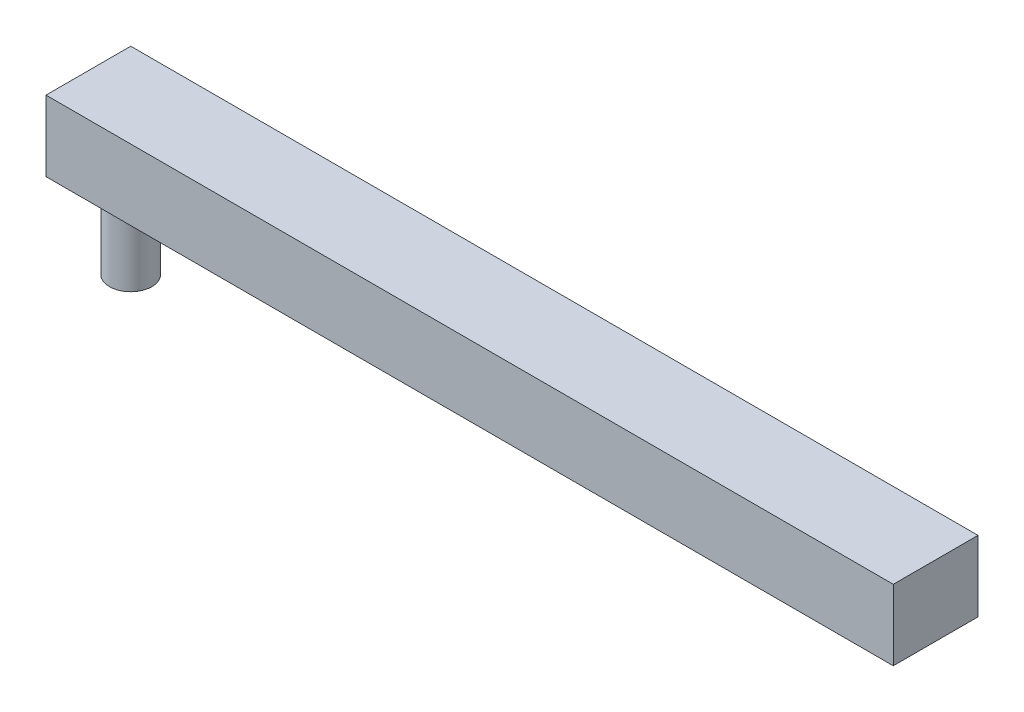
ISO-10303-21;
HEADER;
FILE_DESCRIPTION(('STEP AP214'),'2;1');
FILE_NAME('part.step','',(''),(''),'','','');
FILE_SCHEMA(('AUTOMOTIVE_DESIGN { 1 0 10303 214 1 1 1 1 }'));
ENDSEC;
DATA;
#1=APPLICATION_CONTEXT('core data for automotive mechanical design processes');
#2=APPLICATION_PROTOCOL_DEFINITION('international standard','automotive_design',2000,#1);
#3=PRODUCT_CONTEXT('',#1,'mechanical');
#4=PRODUCT('Part','Part','',(#3));
#5=PRODUCT_RELATED_PRODUCT_CATEGORY('part','',(#4));
#6=PRODUCT_DEFINITION_FORMATION('','',#4);
#7=PRODUCT_DEFINITION_CONTEXT('part definition',#1,'design');
#8=PRODUCT_DEFINITION('design','',#6,#7);
#9=PRODUCT_DEFINITION_SHAPE('','',#8);
#10=(LENGTH_UNIT() NAMED_UNIT(*) SI_UNIT(.MILLI.,.METRE.));
#11=(NAMED_UNIT(*) PLANE_ANGLE_UNIT() SI_UNIT($,.RADIAN.));
#12=(NAMED_UNIT(*) SI_UNIT($,.STERADIAN.) SOLID_ANGLE_UNIT());
#13=UNCERTAINTY_MEASURE_WITH_UNIT(LENGTH_MEASURE(1.E-05),#10,'distance_accuracy_value','');
#14=(GEOMETRIC_REPRESENTATION_CONTEXT(3) GLOBAL_UNCERTAINTY_ASSIGNED_CONTEXT((#13)) GLOBAL_UNIT_ASSIGNED_CONTEXT((#10,
#11,#12)) REPRESENTATION_CONTEXT('',''));
#15=CARTESIAN_POINT('',(0.,0.,0.));
#16=DIRECTION('',(0.,0.,1.));
#17=DIRECTION('',(1.,0.,0.));
#18=AXIS2_PLACEMENT_3D('',#15,#16,#17);
#19=CARTESIAN_POINT('',(52.6835795975409,-4.92847052267303,0.935769113919243));
#20=DIRECTION('',(-1.,0.,0.));
#21=DIRECTION('',(0.,0.,1.));
#22=AXIS2_PLACEMENT_3D('',#19,#20,#21);
#23=PLANE('',#22);
#24=DIRECTION('',(0.,0.,-1.));
#25=VECTOR('',#24,1.);
#26=CARTESIAN_POINT('',(52.6835795975409,-9.92847052267303,0.935769113919243));
#27=LINE('',#26,#25);
#28=CARTESIAN_POINT('',(52.6835795975409,-9.92847052267303,6.93576911391924));
#29=VERTEX_POINT('',#28);
#30=CARTESIAN_POINT('',(52.6835795975409,-9.92847052267303,0.935769113919243));
#31=VERTEX_POINT('',#30);
#32=EDGE_CURVE('E97',#29,#31,#27,.T.);
#33=ORIENTED_EDGE('',*,*,#32,.T.);
#34=DIRECTION('',(0.,-1.,0.));
#35=VECTOR('',#34,1.);
#36=CARTESIAN_POINT('',(52.6835795975409,-4.92847052267303,0.935769113919243));
#37=LINE('',#36,#35);
#38=CARTESIAN_POINT('',(52.6835795975409,-4.92847052267303,0.935769113919243));
#39=VERTEX_POINT('',#38);
#40=EDGE_CURVE('E11',#39,#31,#37,.T.);
#41=ORIENTED_EDGE('',*,*,#40,.F.);
#42=DIRECTION('',(0.,0.,-1.));
#43=VECTOR('',#42,1.);
#44=CARTESIAN_POINT('',(52.6835795975409,-4.92847052267303,0.935769113919243));
#45=LINE('',#44,#43);
#46=CARTESIAN_POINT('',(52.6835795975409,-4.92847052267303,6.93576911391924));
#47=VERTEX_POINT('',#46);
#48=EDGE_CURVE('E83',#47,#39,#45,.T.);
#49=ORIENTED_EDGE('',*,*,#48,.F.);
#50=DIRECTION('',(0.,-1.,0.));
#51=VECTOR('',#50,1.);
#52=CARTESIAN_POINT('',(52.6835795975409,-4.92847052267303,6.93576911391924));
#53=LINE('',#52,#51);
#54=EDGE_CURVE('E93',#47,#29,#53,.T.);
#55=ORIENTED_EDGE('',*,*,#54,.T.);
#56=EDGE_LOOP('',(#33,#41,#49,#55));
#57=FACE_BOUND('',#56,.T.);
#58=ADVANCED_FACE('F33',(#57),#23,.F.);
#59=CARTESIAN_POINT('',(-7.3164204024591,-4.92847052267303,0.935769113919243));
#60=DIRECTION('',(0.,0.,1.));
#61=DIRECTION('',(1.,0.,0.));
#62=AXIS2_PLACEMENT_3D('',#59,#60,#61);
#63=PLANE('',#62);
#64=DIRECTION('',(-1.,0.,0.));
#65=VECTOR('',#64,1.);
#66=CARTESIAN_POINT('',(-7.3164204024591,-9.92847052267303,0.935769113919243));
#67=LINE('',#66,#65);
#68=CARTESIAN_POINT('',(-7.3164204024591,-9.92847052267303,0.935769113919243));
#69=VERTEX_POINT('',#68);
#70=EDGE_CURVE('E88',#31,#69,#67,.T.);
#71=ORIENTED_EDGE('',*,*,#70,.T.);
#72=DIRECTION('',(0.,-1.,0.));
#73=VECTOR('',#72,1.);
#74=CARTESIAN_POINT('',(-7.3164204024591,-4.92847052267303,0.935769113919243));
#75=LINE('',#74,#73);
#76=CARTESIAN_POINT('',(-7.3164204024591,-4.92847052267303,0.935769113919243));
#77=VERTEX_POINT('',#76);
#78=EDGE_CURVE('E41',#77,#69,#75,.T.);
#79=ORIENTED_EDGE('',*,*,#78,.F.);
#80=DIRECTION('',(-1.,0.,0.));
#81=VECTOR('',#80,1.);
#82=CARTESIAN_POINT('',(-7.3164204024591,-4.92847052267303,0.935769113919243));
#83=LINE('',#82,#81);
#84=EDGE_CURVE('E77',#39,#77,#83,.T.);
#85=ORIENTED_EDGE('',*,*,#84,.F.);
#86=ORIENTED_EDGE('',*,*,#40,.T.);
#87=EDGE_LOOP('',(#71,#79,#85,#86));
#88=FACE_BOUND('',#87,.T.);
#89=ADVANCED_FACE('F87',(#88),#63,.F.);
#90=CARTESIAN_POINT('',(-7.3164204024591,-4.92847052267303,6.93576911391924));
#91=DIRECTION('',(1.,0.,0.));
#92=DIRECTION('',(0.,0.,-1.));
#93=AXIS2_PLACEMENT_3D('',#90,#91,#92);
#94=PLANE('',#93);
#95=DIRECTION('',(0.,0.,1.));
#96=VECTOR('',#95,1.);
#97=CARTESIAN_POINT('',(-7.3164204024591,-9.92847052267303,6.93576911391924));
#98=LINE('',#97,#96);
#99=CARTESIAN_POINT('',(-7.3164204024591,-9.92847052267303,6.93576911391924));
#100=VERTEX_POINT('',#99);
#101=EDGE_CURVE('E102',#69,#100,#98,.T.);
#102=ORIENTED_EDGE('',*,*,#101,.T.);
#103=DIRECTION('',(0.,-1.,0.));
#104=VECTOR('',#103,1.);
#105=CARTESIAN_POINT('',(-7.3164204024591,-4.92847052267303,6.93576911391924));
#106=LINE('',#105,#104);
#107=CARTESIAN_POINT('',(-7.3164204024591,-4.92847052267303,6.93576911391924));
#108=VERTEX_POINT('',#107);
#109=EDGE_CURVE('E90',#108,#100,#106,.T.);
#110=ORIENTED_EDGE('',*,*,#109,.F.);
#111=DIRECTION('',(0.,0.,1.));
#112=VECTOR('',#111,1.);
#113=CARTESIAN_POINT('',(-7.3164204024591,-4.92847052267303,6.93576911391924));
#114=LINE('',#113,#112);
#115=EDGE_CURVE('E80',#77,#108,#114,.T.);
#116=ORIENTED_EDGE('',*,*,#115,.F.);
#117=ORIENTED_EDGE('',*,*,#78,.T.);
#118=EDGE_LOOP('',(#102,#110,#116,#117));
#119=FACE_BOUND('',#118,.T.);
#120=ADVANCED_FACE('F91',(#119),#94,.F.);
#121=CARTESIAN_POINT('',(52.6835795975409,-4.92847052267303,6.93576911391924));
#122=DIRECTION('',(0.,0.,-1.));
#123=DIRECTION('',(-1.,0.,0.));
#124=AXIS2_PLACEMENT_3D('',#121,#122,#123);
#125=PLANE('',#124);
#126=DIRECTION('',(1.,0.,0.));
#127=VECTOR('',#126,1.);
#128=CARTESIAN_POINT('',(52.6835795975409,-9.92847052267303,6.93576911391924));
#129=LINE('',#128,#127);
#130=EDGE_CURVE('E66',#100,#29,#129,.T.);
#131=ORIENTED_EDGE('',*,*,#130,.T.);
#132=ORIENTED_EDGE('',*,*,#54,.F.);
#133=DIRECTION('',(1.,0.,0.));
#134=VECTOR('',#133,1.);
#135=CARTESIAN_POINT('',(-2.82057973376634,-4.92847052267303,6.93576911391924));
#136=LINE('',#135,#134);
#137=EDGE_CURVE('E49',#108,#47,#136,.T.);
#138=ORIENTED_EDGE('',*,*,#137,.F.);
#139=ORIENTED_EDGE('',*,*,#109,.T.);
#140=EDGE_LOOP('',(#131,#132,#138,#139));
#141=FACE_BOUND('',#140,.T.);
#142=ADVANCED_FACE('F106',(#141),#125,.F.);
#143=CARTESIAN_POINT('',(0.,-4.92847052267303,0.));
#144=DIRECTION('',(0.,-1.,0.));
#145=DIRECTION('',(0.,0.,-1.));
#146=AXIS2_PLACEMENT_3D('',#143,#144,#145);
#147=PLANE('',#146);
#148=ORIENTED_EDGE('',*,*,#48,.T.);
#149=ORIENTED_EDGE('',*,*,#84,.T.);
#150=ORIENTED_EDGE('',*,*,#115,.T.);
#151=ORIENTED_EDGE('',*,*,#137,.T.);
#152=EDGE_LOOP('',(#148,#149,#150,#151));
#153=FACE_BOUND('',#152,.T.);
#154=ADVANCED_FACE('F78',(#153),#147,.F.);
#155=CARTESIAN_POINT('',(0.,-9.92847052267303,0.));
#156=DIRECTION('',(0.,-1.,0.));
#157=DIRECTION('',(0.,0.,-1.));
#158=AXIS2_PLACEMENT_3D('',#155,#156,#157);
#159=PLANE('',#158);
#160=CARTESIAN_POINT('',(-4.3164204024591,-9.92847052267303,3.93576911391925));
#161=DIRECTION('',(0.,-1.,0.));
#162=DIRECTION('',(0.,0.,-1.));
#163=AXIS2_PLACEMENT_3D('',#160,#161,#162);
#164=CIRCLE('',#163,1.50000000010319);
#165=CARTESIAN_POINT('',(-4.3164204024591,-9.92847052267303,2.43576911381606));
#166=VERTEX_POINT('',#165);
#167=EDGE_CURVE('E109',#166,#166,#164,.T.);
#168=ORIENTED_EDGE('',*,*,#167,.F.);
#169=EDGE_LOOP('',(#168));
#170=FACE_BOUND('',#169,.T.);
#171=ORIENTED_EDGE('',*,*,#32,.F.);
#172=ORIENTED_EDGE('',*,*,#130,.F.);
#173=ORIENTED_EDGE('',*,*,#101,.F.);
#174=ORIENTED_EDGE('',*,*,#70,.F.);
#175=EDGE_LOOP('',(#171,#172,#173,#174));
#176=FACE_BOUND('',#175,.T.);
#177=ADVANCED_FACE('F120',(#170,#176),#159,.T.);
#178=CARTESIAN_POINT('',(-4.3164204024591,-15.928470522673,3.93576911391925));
#179=DIRECTION('',(0.,1.,0.));
#180=DIRECTION('',(0.,0.,1.));
#181=AXIS2_PLACEMENT_3D('',#178,#179,#180);
#182=CYLINDRICAL_SURFACE('',#181,1.50000000010319);
#183=CARTESIAN_POINT('',(-4.3164204024591,-15.928470522673,3.93576911391925));
#184=DIRECTION('',(0.,-1.,0.));
#185=DIRECTION('',(0.,0.,-1.));
#186=AXIS2_PLACEMENT_3D('',#183,#184,#185);
#187=CIRCLE('',#186,1.50000000010319);
#188=CARTESIAN_POINT('',(-4.3164204024591,-15.928470522673,2.43576911381606));
#189=VERTEX_POINT('',#188);
#190=EDGE_CURVE('E100',#189,#189,#187,.T.);
#191=ORIENTED_EDGE('',*,*,#190,.F.);
#192=EDGE_LOOP('',(#191));
#193=FACE_BOUND('',#192,.T.);
#194=ORIENTED_EDGE('',*,*,#167,.T.);
#195=EDGE_LOOP('',(#194));
#196=FACE_BOUND('',#195,.T.);
#197=ADVANCED_FACE('F117',(#193,#196),#182,.T.);
#198=CARTESIAN_POINT('',(-4.3164204024591,-15.928470522673,3.93576911391925));
#199=DIRECTION('',(0.,-1.,0.));
#200=DIRECTION('',(0.,0.,-1.));
#201=AXIS2_PLACEMENT_3D('',#198,#199,#200);
#202=PLANE('',#201);
#203=ORIENTED_EDGE('',*,*,#190,.T.);
#204=EDGE_LOOP('',(#203));
#205=FACE_BOUND('',#204,.T.);
#206=ADVANCED_FACE('F115',(#205),#202,.T.);
#207=CLOSED_SHELL('',(#58,#89,#120,#142,#154,#177,#197,#206));
#208=MANIFOLD_SOLID_BREP('B2',#207);
#209=ADVANCED_BREP_SHAPE_REPRESENTATION('',(#18,#208),#14);
#210=SHAPE_DEFINITION_REPRESENTATION(#9,#209);
ENDSEC;
END-ISO-10303-21;
